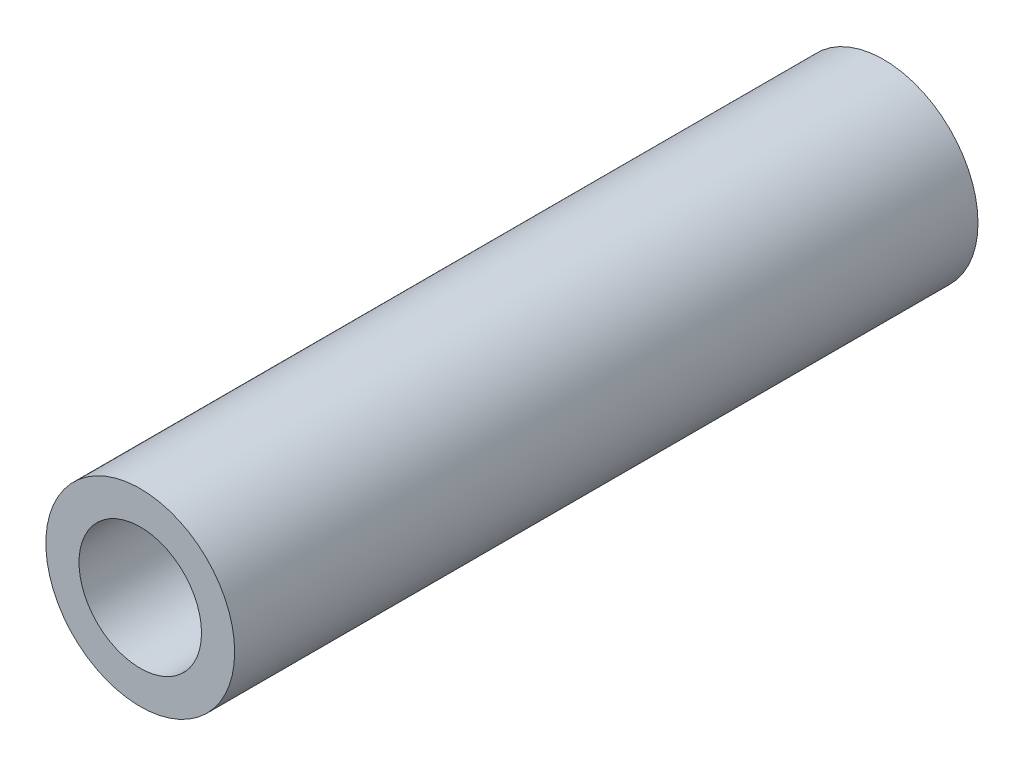
ISO-10303-21;
HEADER;
FILE_DESCRIPTION(('STEP AP214'),'2;1');
FILE_NAME('part.step','',(''),(''),'','','');
FILE_SCHEMA(('AUTOMOTIVE_DESIGN { 1 0 10303 214 1 1 1 1 }'));
ENDSEC;
DATA;
#1=APPLICATION_CONTEXT('core data for automotive mechanical design processes');
#2=APPLICATION_PROTOCOL_DEFINITION('international standard','automotive_design',2000,#1);
#3=PRODUCT_CONTEXT('',#1,'mechanical');
#4=PRODUCT('Part','Part','',(#3));
#5=PRODUCT_RELATED_PRODUCT_CATEGORY('part','',(#4));
#6=PRODUCT_DEFINITION_FORMATION('','',#4);
#7=PRODUCT_DEFINITION_CONTEXT('part definition',#1,'design');
#8=PRODUCT_DEFINITION('design','',#6,#7);
#9=PRODUCT_DEFINITION_SHAPE('','',#8);
#10=(LENGTH_UNIT() NAMED_UNIT(*) SI_UNIT(.MILLI.,.METRE.));
#11=(NAMED_UNIT(*) PLANE_ANGLE_UNIT() SI_UNIT($,.RADIAN.));
#12=(NAMED_UNIT(*) SI_UNIT($,.STERADIAN.) SOLID_ANGLE_UNIT());
#13=UNCERTAINTY_MEASURE_WITH_UNIT(LENGTH_MEASURE(1.E-05),#10,'distance_accuracy_value','');
#14=(GEOMETRIC_REPRESENTATION_CONTEXT(3) GLOBAL_UNCERTAINTY_ASSIGNED_CONTEXT((#13)) GLOBAL_UNIT_ASSIGNED_CONTEXT((#10,
#11,#12)) REPRESENTATION_CONTEXT('',''));
#15=CARTESIAN_POINT('',(0.,0.,0.));
#16=DIRECTION('',(0.,0.,1.));
#17=DIRECTION('',(1.,0.,0.));
#18=AXIS2_PLACEMENT_3D('',#15,#16,#17);
#19=CARTESIAN_POINT('',(0.,0.,250.));
#20=DIRECTION('',(0.,0.,1.));
#21=DIRECTION('',(1.,0.,0.));
#22=AXIS2_PLACEMENT_3D('',#19,#20,#21);
#23=PLANE('',#22);
#24=CARTESIAN_POINT('',(0.,0.,250.));
#25=DIRECTION('',(0.,0.,1.));
#26=DIRECTION('',(1.,0.,0.));
#27=AXIS2_PLACEMENT_3D('',#24,#25,#26);
#28=CIRCLE('',#27,31.75);
#29=CARTESIAN_POINT('',(31.75,0.,250.));
#30=VERTEX_POINT('',#29);
#31=EDGE_CURVE('E10',#30,#30,#28,.T.);
#32=ORIENTED_EDGE('',*,*,#31,.T.);
#33=EDGE_LOOP('',(#32));
#34=FACE_BOUND('',#33,.T.);
#35=CARTESIAN_POINT('',(0.,0.,250.));
#36=DIRECTION('',(0.,0.,1.));
#37=DIRECTION('',(1.,0.,0.));
#38=AXIS2_PLACEMENT_3D('',#35,#36,#37);
#39=CIRCLE('',#38,20.6);
#40=CARTESIAN_POINT('',(20.6,0.,250.));
#41=VERTEX_POINT('',#40);
#42=EDGE_CURVE('E44',#41,#41,#39,.T.);
#43=ORIENTED_EDGE('',*,*,#42,.F.);
#44=EDGE_LOOP('',(#43));
#45=FACE_BOUND('',#44,.T.);
#46=ADVANCED_FACE('F33',(#34,#45),#23,.T.);
#47=CARTESIAN_POINT('',(0.,0.,0.));
#48=DIRECTION('',(0.,0.,1.));
#49=DIRECTION('',(1.,0.,0.));
#50=AXIS2_PLACEMENT_3D('',#47,#48,#49);
#51=PLANE('',#50);
#52=CARTESIAN_POINT('',(0.,0.,0.));
#53=DIRECTION('',(0.,0.,1.));
#54=DIRECTION('',(1.,0.,0.));
#55=AXIS2_PLACEMENT_3D('',#52,#53,#54);
#56=CIRCLE('',#55,31.75);
#57=CARTESIAN_POINT('',(31.75,0.,0.));
#58=VERTEX_POINT('',#57);
#59=EDGE_CURVE('E37',#58,#58,#56,.T.);
#60=ORIENTED_EDGE('',*,*,#59,.F.);
#61=EDGE_LOOP('',(#60));
#62=FACE_BOUND('',#61,.T.);
#63=CARTESIAN_POINT('',(0.,0.,0.));
#64=DIRECTION('',(0.,0.,1.));
#65=DIRECTION('',(1.,0.,0.));
#66=AXIS2_PLACEMENT_3D('',#63,#64,#65);
#67=CIRCLE('',#66,20.6);
#68=CARTESIAN_POINT('',(20.6,0.,0.));
#69=VERTEX_POINT('',#68);
#70=EDGE_CURVE('E46',#69,#69,#67,.T.);
#71=ORIENTED_EDGE('',*,*,#70,.T.);
#72=EDGE_LOOP('',(#71));
#73=FACE_BOUND('',#72,.T.);
#74=ADVANCED_FACE('F56',(#62,#73),#51,.F.);
#75=CARTESIAN_POINT('',(0.,0.,250.));
#76=DIRECTION('',(0.,0.,-1.));
#77=DIRECTION('',(-1.,0.,0.));
#78=AXIS2_PLACEMENT_3D('',#75,#76,#77);
#79=CYLINDRICAL_SURFACE('',#78,31.75);
#80=ORIENTED_EDGE('',*,*,#31,.F.);
#81=EDGE_LOOP('',(#80));
#82=FACE_BOUND('',#81,.T.);
#83=ORIENTED_EDGE('',*,*,#59,.T.);
#84=EDGE_LOOP('',(#83));
#85=FACE_BOUND('',#84,.T.);
#86=ADVANCED_FACE('F35',(#82,#85),#79,.T.);
#87=CARTESIAN_POINT('',(0.,0.,250.));
#88=DIRECTION('',(0.,0.,-1.));
#89=DIRECTION('',(-1.,0.,0.));
#90=AXIS2_PLACEMENT_3D('',#87,#88,#89);
#91=CYLINDRICAL_SURFACE('',#90,20.6);
#92=ORIENTED_EDGE('',*,*,#42,.T.);
#93=EDGE_LOOP('',(#92));
#94=FACE_BOUND('',#93,.T.);
#95=ORIENTED_EDGE('',*,*,#70,.F.);
#96=EDGE_LOOP('',(#95));
#97=FACE_BOUND('',#96,.T.);
#98=ADVANCED_FACE('F52',(#94,#97),#91,.F.);
#99=CLOSED_SHELL('',(#46,#74,#86,#98));
#100=MANIFOLD_SOLID_BREP('B2',#99);
#101=ADVANCED_BREP_SHAPE_REPRESENTATION('',(#18,#100),#14);
#102=SHAPE_DEFINITION_REPRESENTATION(#9,#101);
ENDSEC;
END-ISO-10303-21;
